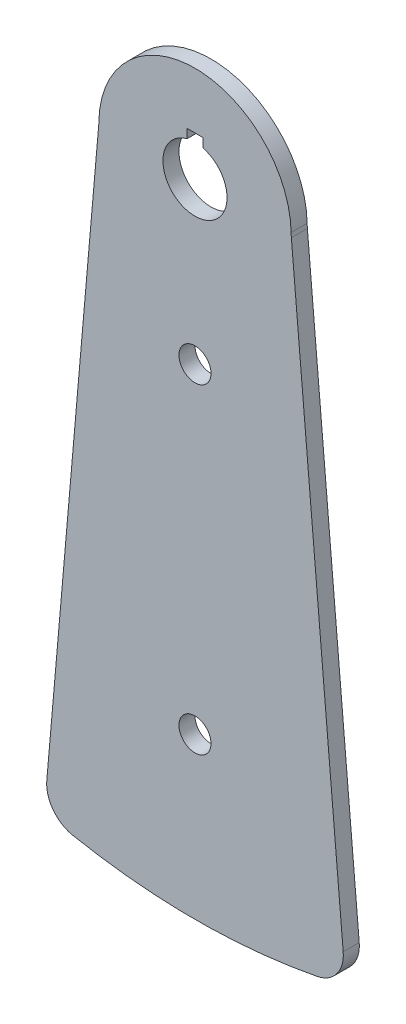
ISO-10303-21;
HEADER;
FILE_DESCRIPTION(('STEP AP214'),'2;1');
FILE_NAME('part.step','',(''),(''),'','','');
FILE_SCHEMA(('AUTOMOTIVE_DESIGN { 1 0 10303 214 1 1 1 1 }'));
ENDSEC;
DATA;
#1=APPLICATION_CONTEXT('core data for automotive mechanical design processes');
#2=APPLICATION_PROTOCOL_DEFINITION('international standard','automotive_design',2000,#1);
#3=PRODUCT_CONTEXT('',#1,'mechanical');
#4=PRODUCT('Part','Part','',(#3));
#5=PRODUCT_RELATED_PRODUCT_CATEGORY('part','',(#4));
#6=PRODUCT_DEFINITION_FORMATION('','',#4);
#7=PRODUCT_DEFINITION_CONTEXT('part definition',#1,'design');
#8=PRODUCT_DEFINITION('design','',#6,#7);
#9=PRODUCT_DEFINITION_SHAPE('','',#8);
#10=(LENGTH_UNIT() NAMED_UNIT(*) SI_UNIT(.MILLI.,.METRE.));
#11=(NAMED_UNIT(*) PLANE_ANGLE_UNIT() SI_UNIT($,.RADIAN.));
#12=(NAMED_UNIT(*) SI_UNIT($,.STERADIAN.) SOLID_ANGLE_UNIT());
#13=UNCERTAINTY_MEASURE_WITH_UNIT(LENGTH_MEASURE(1.E-05),#10,'distance_accuracy_value','');
#14=(GEOMETRIC_REPRESENTATION_CONTEXT(3) GLOBAL_UNCERTAINTY_ASSIGNED_CONTEXT((#13)) GLOBAL_UNIT_ASSIGNED_CONTEXT((#10,
#11,#12)) REPRESENTATION_CONTEXT('',''));
#15=CARTESIAN_POINT('',(0.,0.,0.));
#16=DIRECTION('',(0.,0.,1.));
#17=DIRECTION('',(1.,0.,0.));
#18=AXIS2_PLACEMENT_3D('',#15,#16,#17);
#19=CARTESIAN_POINT('',(0.,0.,3.175));
#20=DIRECTION('',(0.,0.,1.));
#21=DIRECTION('',(1.,0.,0.));
#22=AXIS2_PLACEMENT_3D('',#19,#20,#21);
#23=PLANE('',#22);
#24=CARTESIAN_POINT('',(0.,-190.5,3.175));
#25=DIRECTION('',(0.,0.,1.));
#26=DIRECTION('',(1.,0.,0.));
#27=AXIS2_PLACEMENT_3D('',#24,#25,#26);
#28=CIRCLE('',#27,6.35);
#29=CARTESIAN_POINT('',(6.35000000000002,-190.5,3.175));
#30=VERTEX_POINT('',#29);
#31=EDGE_CURVE('E401',#30,#30,#28,.T.);
#32=ORIENTED_EDGE('',*,*,#31,.F.);
#33=EDGE_LOOP('',(#32));
#34=FACE_BOUND('',#33,.T.);
#35=CARTESIAN_POINT('',(0.,-63.5,3.175));
#36=DIRECTION('',(0.,0.,1.));
#37=DIRECTION('',(1.,0.,0.));
#38=AXIS2_PLACEMENT_3D('',#35,#36,#37);
#39=CIRCLE('',#38,6.35);
#40=CARTESIAN_POINT('',(6.35000000000001,-63.5,3.175));
#41=VERTEX_POINT('',#40);
#42=EDGE_CURVE('E154',#41,#41,#39,.T.);
#43=ORIENTED_EDGE('',*,*,#42,.F.);
#44=EDGE_LOOP('',(#43));
#45=FACE_BOUND('',#44,.T.);
#46=CARTESIAN_POINT('',(0.,0.,3.175));
#47=DIRECTION('',(0.,0.,1.));
#48=DIRECTION('',(1.,0.,0.));
#49=AXIS2_PLACEMENT_3D('',#46,#47,#48);
#50=CIRCLE('',#49,254.);
#51=CARTESIAN_POINT('',(-48.4990435923038,-249.326779088472,3.175));
#52=VERTEX_POINT('',#51);
#53=CARTESIAN_POINT('',(48.4990435923038,-249.326779088472,3.175));
#54=VERTEX_POINT('',#53);
#55=EDGE_CURVE('E170',#52,#54,#50,.T.);
#56=ORIENTED_EDGE('',*,*,#55,.T.);
#57=CARTESIAN_POINT('',(46.0740914126886,-236.860440134049,3.175));
#58=DIRECTION('',(0.,0.,1.));
#59=DIRECTION('',(1.,0.,0.));
#60=AXIS2_PLACEMENT_3D('',#57,#58,#59);
#61=CIRCLE('',#60,12.7);
#62=CARTESIAN_POINT('',(58.7257640784538,-235.753562201153,3.175));
#63=VERTEX_POINT('',#62);
#64=EDGE_CURVE('E44',#54,#63,#61,.T.);
#65=ORIENTED_EDGE('',*,*,#64,.T.);
#66=DIRECTION('',(-0.0871557427476544,0.996194698091746,0.));
#67=VECTOR('',#66,1.);
#68=CARTESIAN_POINT('',(38.1843597954435,-0.964236874169337,3.175));
#69=LINE('',#68,#67);
#70=CARTESIAN_POINT('',(38.1843597954435,-0.964236874169344,3.175));
#71=VERTEX_POINT('',#70);
#72=EDGE_CURVE('E172',#63,#71,#69,.T.);
#73=ORIENTED_EDGE('',*,*,#72,.T.);
#74=CARTESIAN_POINT('',(63.4877051269738,1.24951899162109,3.175));
#75=DIRECTION('',(0.,0.,-1.));
#76=DIRECTION('',(-1.,0.,0.));
#77=AXIS2_PLACEMENT_3D('',#74,#75,#76);
#78=CIRCLE('',#77,25.4);
#79=CARTESIAN_POINT('',(38.0926230761843,0.749711394972652,3.175));
#80=VERTEX_POINT('',#79);
#81=EDGE_CURVE('E175',#71,#80,#78,.T.);
#82=ORIENTED_EDGE('',*,*,#81,.T.);
#83=CARTESIAN_POINT('',(0.,0.,3.175));
#84=DIRECTION('',(0.,0.,1.));
#85=DIRECTION('',(1.,0.,0.));
#86=AXIS2_PLACEMENT_3D('',#83,#84,#85);
#87=CIRCLE('',#86,38.1);
#88=CARTESIAN_POINT('',(-38.0926230761843,0.74971139497264,3.175));
#89=VERTEX_POINT('',#88);
#90=EDGE_CURVE('E177',#80,#89,#87,.T.);
#91=ORIENTED_EDGE('',*,*,#90,.T.);
#92=CARTESIAN_POINT('',(-63.4877051269738,1.24951899162107,3.175));
#93=DIRECTION('',(0.,0.,-1.));
#94=DIRECTION('',(1.,0.,0.));
#95=AXIS2_PLACEMENT_3D('',#92,#93,#94);
#96=CIRCLE('',#95,25.4);
#97=CARTESIAN_POINT('',(-38.1843597954435,-0.964236874169347,3.175));
#98=VERTEX_POINT('',#97);
#99=EDGE_CURVE('E179',#89,#98,#96,.T.);
#100=ORIENTED_EDGE('',*,*,#99,.T.);
#101=DIRECTION('',(-0.0871557427476543,-0.996194698091746,0.));
#102=VECTOR('',#101,1.);
#103=CARTESIAN_POINT('',(-59.6995953012024,-246.884504011233,3.175));
#104=LINE('',#103,#102);
#105=CARTESIAN_POINT('',(-58.7257640784538,-235.753562201153,3.175));
#106=VERTEX_POINT('',#105);
#107=EDGE_CURVE('E181',#98,#106,#104,.T.);
#108=ORIENTED_EDGE('',*,*,#107,.T.);
#109=CARTESIAN_POINT('',(-46.0740914126886,-236.860440134049,3.175));
#110=DIRECTION('',(0.,0.,1.));
#111=DIRECTION('',(1.,0.,0.));
#112=AXIS2_PLACEMENT_3D('',#109,#110,#111);
#113=CIRCLE('',#112,12.7);
#114=EDGE_CURVE('E220',#106,#52,#113,.T.);
#115=ORIENTED_EDGE('',*,*,#114,.T.);
#116=EDGE_LOOP('',(#56,#65,#73,#82,#91,#100,#108,#115));
#117=FACE_BOUND('',#116,.T.);
#118=CARTESIAN_POINT('',(0.,0.,3.175));
#119=DIRECTION('',(0.,0.,1.));
#120=DIRECTION('',(1.,0.,0.));
#121=AXIS2_PLACEMENT_3D('',#118,#119,#120);
#122=CIRCLE('',#121,12.7);
#123=CARTESIAN_POINT('',(-3.175,12.2967221242086,3.175));
#124=VERTEX_POINT('',#123);
#125=CARTESIAN_POINT('',(3.175,12.2967221242085,3.175));
#126=VERTEX_POINT('',#125);
#127=EDGE_CURVE('E150',#124,#126,#122,.T.);
#128=ORIENTED_EDGE('',*,*,#127,.F.);
#129=DIRECTION('',(0.,1.,0.));
#130=VECTOR('',#129,1.);
#131=CARTESIAN_POINT('',(-3.175,9.525,3.175));
#132=LINE('',#131,#130);
#133=CARTESIAN_POINT('',(-3.175,15.875,3.175));
#134=VERTEX_POINT('',#133);
#135=EDGE_CURVE('E130',#124,#134,#132,.T.);
#136=ORIENTED_EDGE('',*,*,#135,.T.);
#137=DIRECTION('',(-1.,0.,0.));
#138=VECTOR('',#137,1.);
#139=CARTESIAN_POINT('',(3.175,15.875,3.175));
#140=LINE('',#139,#138);
#141=CARTESIAN_POINT('',(3.175,15.875,3.175));
#142=VERTEX_POINT('',#141);
#143=EDGE_CURVE('E142',#142,#134,#140,.T.);
#144=ORIENTED_EDGE('',*,*,#143,.F.);
#145=DIRECTION('',(0.,1.,0.));
#146=VECTOR('',#145,1.);
#147=CARTESIAN_POINT('',(3.175,9.525,3.175));
#148=LINE('',#147,#146);
#149=EDGE_CURVE('E146',#126,#142,#148,.T.);
#150=ORIENTED_EDGE('',*,*,#149,.F.);
#151=EDGE_LOOP('',(#128,#136,#144,#150));
#152=FACE_BOUND('',#151,.T.);
#153=ADVANCED_FACE('F36',(#34,#45,#117,#152),#23,.T.);
#154=CARTESIAN_POINT('',(0.,0.,-3.175));
#155=DIRECTION('',(0.,0.,1.));
#156=DIRECTION('',(1.,0.,0.));
#157=AXIS2_PLACEMENT_3D('',#154,#155,#156);
#158=PLANE('',#157);
#159=CARTESIAN_POINT('',(0.,-190.5,-3.175));
#160=DIRECTION('',(0.,0.,1.));
#161=DIRECTION('',(1.,0.,0.));
#162=AXIS2_PLACEMENT_3D('',#159,#160,#161);
#163=CIRCLE('',#162,6.35);
#164=CARTESIAN_POINT('',(6.35000000000002,-190.5,-3.175));
#165=VERTEX_POINT('',#164);
#166=EDGE_CURVE('E399',#165,#165,#163,.T.);
#167=ORIENTED_EDGE('',*,*,#166,.T.);
#168=EDGE_LOOP('',(#167));
#169=FACE_BOUND('',#168,.T.);
#170=CARTESIAN_POINT('',(0.,-63.5,-3.175));
#171=DIRECTION('',(0.,0.,1.));
#172=DIRECTION('',(1.,0.,0.));
#173=AXIS2_PLACEMENT_3D('',#170,#171,#172);
#174=CIRCLE('',#173,6.35);
#175=CARTESIAN_POINT('',(6.35000000000001,-63.5,-3.175));
#176=VERTEX_POINT('',#175);
#177=EDGE_CURVE('E151',#176,#176,#174,.T.);
#178=ORIENTED_EDGE('',*,*,#177,.T.);
#179=EDGE_LOOP('',(#178));
#180=FACE_BOUND('',#179,.T.);
#181=DIRECTION('',(-0.0871557427476544,0.996194698091746,0.));
#182=VECTOR('',#181,1.);
#183=CARTESIAN_POINT('',(38.1843597954435,-0.964236874169337,-3.175));
#184=LINE('',#183,#182);
#185=CARTESIAN_POINT('',(58.7257640784538,-235.753562201153,-3.175));
#186=VERTEX_POINT('',#185);
#187=CARTESIAN_POINT('',(38.1843597954435,-0.964236874169344,-3.175));
#188=VERTEX_POINT('',#187);
#189=EDGE_CURVE('E185',#186,#188,#184,.T.);
#190=ORIENTED_EDGE('',*,*,#189,.F.);
#191=CARTESIAN_POINT('',(46.0740914126886,-236.860440134049,-3.175));
#192=DIRECTION('',(0.,0.,1.));
#193=DIRECTION('',(1.,0.,0.));
#194=AXIS2_PLACEMENT_3D('',#191,#192,#193);
#195=CIRCLE('',#194,12.7);
#196=CARTESIAN_POINT('',(48.4990435923038,-249.326779088472,-3.175));
#197=VERTEX_POINT('',#196);
#198=EDGE_CURVE('E214',#186,#197,#195,.F.);
#199=ORIENTED_EDGE('',*,*,#198,.T.);
#200=CARTESIAN_POINT('',(0.,0.,-3.175));
#201=DIRECTION('',(0.,0.,1.));
#202=DIRECTION('',(1.,0.,0.));
#203=AXIS2_PLACEMENT_3D('',#200,#201,#202);
#204=CIRCLE('',#203,254.);
#205=CARTESIAN_POINT('',(-48.4990435923038,-249.326779088472,-3.175));
#206=VERTEX_POINT('',#205);
#207=EDGE_CURVE('E167',#206,#197,#204,.T.);
#208=ORIENTED_EDGE('',*,*,#207,.F.);
#209=CARTESIAN_POINT('',(-46.0740914126886,-236.860440134049,-3.175));
#210=DIRECTION('',(0.,0.,1.));
#211=DIRECTION('',(1.,0.,0.));
#212=AXIS2_PLACEMENT_3D('',#209,#210,#211);
#213=CIRCLE('',#212,12.7);
#214=CARTESIAN_POINT('',(-58.7257640784538,-235.753562201153,-3.175));
#215=VERTEX_POINT('',#214);
#216=EDGE_CURVE('E212',#206,#215,#213,.F.);
#217=ORIENTED_EDGE('',*,*,#216,.T.);
#218=DIRECTION('',(-0.0871557427476543,-0.996194698091746,0.));
#219=VECTOR('',#218,1.);
#220=CARTESIAN_POINT('',(-59.6995953012024,-246.884504011233,-3.175));
#221=LINE('',#220,#219);
#222=CARTESIAN_POINT('',(-38.1843597954435,-0.964236874169347,-3.175));
#223=VERTEX_POINT('',#222);
#224=EDGE_CURVE('E173',#223,#215,#221,.T.);
#225=ORIENTED_EDGE('',*,*,#224,.F.);
#226=CARTESIAN_POINT('',(-63.4877051269738,1.24951899162107,-3.175));
#227=DIRECTION('',(0.,0.,-1.));
#228=DIRECTION('',(1.,0.,0.));
#229=AXIS2_PLACEMENT_3D('',#226,#227,#228);
#230=CIRCLE('',#229,25.4);
#231=CARTESIAN_POINT('',(-38.0926230761843,0.74971139497264,-3.175));
#232=VERTEX_POINT('',#231);
#233=EDGE_CURVE('E191',#232,#223,#230,.T.);
#234=ORIENTED_EDGE('',*,*,#233,.F.);
#235=CARTESIAN_POINT('',(0.,0.,-3.175));
#236=DIRECTION('',(0.,0.,1.));
#237=DIRECTION('',(1.,0.,0.));
#238=AXIS2_PLACEMENT_3D('',#235,#236,#237);
#239=CIRCLE('',#238,38.1);
#240=CARTESIAN_POINT('',(38.0926230761843,0.749711394972652,-3.175));
#241=VERTEX_POINT('',#240);
#242=EDGE_CURVE('E189',#241,#232,#239,.T.);
#243=ORIENTED_EDGE('',*,*,#242,.F.);
#244=CARTESIAN_POINT('',(63.4877051269738,1.24951899162109,-3.175));
#245=DIRECTION('',(0.,0.,-1.));
#246=DIRECTION('',(-1.,0.,0.));
#247=AXIS2_PLACEMENT_3D('',#244,#245,#246);
#248=CIRCLE('',#247,25.4);
#249=EDGE_CURVE('E187',#188,#241,#248,.T.);
#250=ORIENTED_EDGE('',*,*,#249,.F.);
#251=EDGE_LOOP('',(#190,#199,#208,#217,#225,#234,#243,#250));
#252=FACE_BOUND('',#251,.T.);
#253=DIRECTION('',(0.,1.,0.));
#254=VECTOR('',#253,1.);
#255=CARTESIAN_POINT('',(-3.175,9.525,-3.175));
#256=LINE('',#255,#254);
#257=CARTESIAN_POINT('',(-3.175,12.2967221242086,-3.175));
#258=VERTEX_POINT('',#257);
#259=CARTESIAN_POINT('',(-3.175,15.875,-3.175));
#260=VERTEX_POINT('',#259);
#261=EDGE_CURVE('E133',#258,#260,#256,.T.);
#262=ORIENTED_EDGE('',*,*,#261,.F.);
#263=CARTESIAN_POINT('',(0.,0.,-3.175));
#264=DIRECTION('',(0.,0.,1.));
#265=DIRECTION('',(1.,0.,0.));
#266=AXIS2_PLACEMENT_3D('',#263,#264,#265);
#267=CIRCLE('',#266,12.7);
#268=CARTESIAN_POINT('',(3.175,12.2967221242085,-3.175));
#269=VERTEX_POINT('',#268);
#270=EDGE_CURVE('E137',#258,#269,#267,.T.);
#271=ORIENTED_EDGE('',*,*,#270,.T.);
#272=DIRECTION('',(0.,1.,0.));
#273=VECTOR('',#272,1.);
#274=CARTESIAN_POINT('',(3.175,9.525,-3.175));
#275=LINE('',#274,#273);
#276=CARTESIAN_POINT('',(3.175,15.875,-3.175));
#277=VERTEX_POINT('',#276);
#278=EDGE_CURVE('E162',#269,#277,#275,.T.);
#279=ORIENTED_EDGE('',*,*,#278,.T.);
#280=DIRECTION('',(-1.,0.,0.));
#281=VECTOR('',#280,1.);
#282=CARTESIAN_POINT('',(3.175,15.875,-3.175));
#283=LINE('',#282,#281);
#284=EDGE_CURVE('E160',#277,#260,#283,.T.);
#285=ORIENTED_EDGE('',*,*,#284,.T.);
#286=EDGE_LOOP('',(#262,#271,#279,#285));
#287=FACE_BOUND('',#286,.T.);
#288=ADVANCED_FACE('F234',(#169,#180,#252,#287),#158,.F.);
#289=CARTESIAN_POINT('',(0.,0.,3.175));
#290=DIRECTION('',(0.,0.,-1.));
#291=DIRECTION('',(-1.,0.,0.));
#292=AXIS2_PLACEMENT_3D('',#289,#290,#291);
#293=CYLINDRICAL_SURFACE('',#292,12.7);
#294=ORIENTED_EDGE('',*,*,#270,.F.);
#295=DIRECTION('',(0.,0.,-1.));
#296=VECTOR('',#295,1.);
#297=CARTESIAN_POINT('',(-3.175,12.2967221242086,3.175));
#298=LINE('',#297,#296);
#299=EDGE_CURVE('E207',#258,#124,#298,.F.);
#300=ORIENTED_EDGE('',*,*,#299,.T.);
#301=ORIENTED_EDGE('',*,*,#127,.T.);
#302=DIRECTION('',(0.,0.,-1.));
#303=VECTOR('',#302,1.);
#304=CARTESIAN_POINT('',(3.175,12.2967221242085,3.175));
#305=LINE('',#304,#303);
#306=EDGE_CURVE('E205',#269,#126,#305,.F.);
#307=ORIENTED_EDGE('',*,*,#306,.F.);
#308=EDGE_LOOP('',(#294,#300,#301,#307));
#309=FACE_BOUND('',#308,.T.);
#310=ADVANCED_FACE('F272',(#309),#293,.F.);
#311=CARTESIAN_POINT('',(0.,0.,3.175));
#312=DIRECTION('',(0.,0.,-1.));
#313=DIRECTION('',(-1.,0.,0.));
#314=AXIS2_PLACEMENT_3D('',#311,#312,#313);
#315=CYLINDRICAL_SURFACE('',#314,254.);
#316=ORIENTED_EDGE('',*,*,#207,.T.);
#317=DIRECTION('',(0.,0.,-1.));
#318=VECTOR('',#317,1.);
#319=CARTESIAN_POINT('',(48.4990435923038,-249.326779088472,3.175));
#320=LINE('',#319,#318);
#321=EDGE_CURVE('E57',#197,#54,#320,.F.);
#322=ORIENTED_EDGE('',*,*,#321,.T.);
#323=ORIENTED_EDGE('',*,*,#55,.F.);
#324=DIRECTION('',(0.,0.,-1.));
#325=VECTOR('',#324,1.);
#326=CARTESIAN_POINT('',(-48.4990435923038,-249.326779088472,3.175));
#327=LINE('',#326,#325);
#328=EDGE_CURVE('E216',#52,#206,#327,.T.);
#329=ORIENTED_EDGE('',*,*,#328,.T.);
#330=EDGE_LOOP('',(#316,#322,#323,#329));
#331=FACE_BOUND('',#330,.T.);
#332=ADVANCED_FACE('F237',(#331),#315,.T.);
#333=CARTESIAN_POINT('',(38.1843597954435,-0.964236874169337,3.175));
#334=DIRECTION('',(-0.996194698091746,-0.0871557427476544,0.));
#335=DIRECTION('',(0.0871557427476545,-0.996194698091746,0.));
#336=AXIS2_PLACEMENT_3D('',#333,#334,#335);
#337=PLANE('',#336);
#338=ORIENTED_EDGE('',*,*,#72,.F.);
#339=DIRECTION('',(0.,0.,-1.));
#340=VECTOR('',#339,1.);
#341=CARTESIAN_POINT('',(58.7257640784538,-235.753562201153,3.175));
#342=LINE('',#341,#340);
#343=EDGE_CURVE('E209',#63,#186,#342,.T.);
#344=ORIENTED_EDGE('',*,*,#343,.T.);
#345=ORIENTED_EDGE('',*,*,#189,.T.);
#346=DIRECTION('',(0.,0.,-1.));
#347=VECTOR('',#346,1.);
#348=CARTESIAN_POINT('',(38.1843597954435,-0.964236874169344,3.175));
#349=LINE('',#348,#347);
#350=EDGE_CURVE('E202',#71,#188,#349,.T.);
#351=ORIENTED_EDGE('',*,*,#350,.F.);
#352=EDGE_LOOP('',(#338,#344,#345,#351));
#353=FACE_BOUND('',#352,.T.);
#354=ADVANCED_FACE('F228',(#353),#337,.F.);
#355=CARTESIAN_POINT('',(63.4877051269738,1.24951899162109,3.175));
#356=DIRECTION('',(0.,0.,-1.));
#357=DIRECTION('',(-1.,0.,0.));
#358=AXIS2_PLACEMENT_3D('',#355,#356,#357);
#359=CYLINDRICAL_SURFACE('',#358,25.4);
#360=ORIENTED_EDGE('',*,*,#249,.T.);
#361=DIRECTION('',(0.,0.,-1.));
#362=VECTOR('',#361,1.);
#363=CARTESIAN_POINT('',(38.0926230761843,0.749711394972652,3.175));
#364=LINE('',#363,#362);
#365=EDGE_CURVE('E199',#80,#241,#364,.T.);
#366=ORIENTED_EDGE('',*,*,#365,.F.);
#367=ORIENTED_EDGE('',*,*,#81,.F.);
#368=ORIENTED_EDGE('',*,*,#350,.T.);
#369=EDGE_LOOP('',(#360,#366,#367,#368));
#370=FACE_BOUND('',#369,.T.);
#371=ADVANCED_FACE('F255',(#370),#359,.F.);
#372=CARTESIAN_POINT('',(0.,0.,3.175));
#373=DIRECTION('',(0.,0.,-1.));
#374=DIRECTION('',(-1.,0.,0.));
#375=AXIS2_PLACEMENT_3D('',#372,#373,#374);
#376=CYLINDRICAL_SURFACE('',#375,38.1);
#377=ORIENTED_EDGE('',*,*,#242,.T.);
#378=DIRECTION('',(0.,0.,-1.));
#379=VECTOR('',#378,1.);
#380=CARTESIAN_POINT('',(-38.0926230761843,0.74971139497264,3.175));
#381=LINE('',#380,#379);
#382=EDGE_CURVE('E196',#89,#232,#381,.T.);
#383=ORIENTED_EDGE('',*,*,#382,.F.);
#384=ORIENTED_EDGE('',*,*,#90,.F.);
#385=ORIENTED_EDGE('',*,*,#365,.T.);
#386=EDGE_LOOP('',(#377,#383,#384,#385));
#387=FACE_BOUND('',#386,.T.);
#388=ADVANCED_FACE('F251',(#387),#376,.T.);
#389=CARTESIAN_POINT('',(-63.4877051269738,1.24951899162107,3.175));
#390=DIRECTION('',(0.,0.,-1.));
#391=DIRECTION('',(-1.,0.,0.));
#392=AXIS2_PLACEMENT_3D('',#389,#390,#391);
#393=CYLINDRICAL_SURFACE('',#392,25.4);
#394=ORIENTED_EDGE('',*,*,#233,.T.);
#395=DIRECTION('',(0.,0.,-1.));
#396=VECTOR('',#395,1.);
#397=CARTESIAN_POINT('',(-38.1843597954435,-0.964236874169347,3.175));
#398=LINE('',#397,#396);
#399=EDGE_CURVE('E183',#98,#223,#398,.T.);
#400=ORIENTED_EDGE('',*,*,#399,.F.);
#401=ORIENTED_EDGE('',*,*,#99,.F.);
#402=ORIENTED_EDGE('',*,*,#382,.T.);
#403=EDGE_LOOP('',(#394,#400,#401,#402));
#404=FACE_BOUND('',#403,.T.);
#405=ADVANCED_FACE('F247',(#404),#393,.F.);
#406=CARTESIAN_POINT('',(-59.6995953012024,-246.884504011233,3.175));
#407=DIRECTION('',(0.996194698091746,-0.0871557427476543,0.));
#408=DIRECTION('',(0.0871557427476543,0.996194698091746,0.));
#409=AXIS2_PLACEMENT_3D('',#406,#407,#408);
#410=PLANE('',#409);
#411=ORIENTED_EDGE('',*,*,#224,.T.);
#412=DIRECTION('',(0.,0.,-1.));
#413=VECTOR('',#412,1.);
#414=CARTESIAN_POINT('',(-58.7257640784538,-235.753562201153,3.175));
#415=LINE('',#414,#413);
#416=EDGE_CURVE('E11',#215,#106,#415,.F.);
#417=ORIENTED_EDGE('',*,*,#416,.T.);
#418=ORIENTED_EDGE('',*,*,#107,.F.);
#419=ORIENTED_EDGE('',*,*,#399,.T.);
#420=EDGE_LOOP('',(#411,#417,#418,#419));
#421=FACE_BOUND('',#420,.T.);
#422=ADVANCED_FACE('F243',(#421),#410,.F.);
#423=CARTESIAN_POINT('',(-3.175,9.525,-3.175));
#424=DIRECTION('',(1.,0.,0.));
#425=DIRECTION('',(0.,0.,-1.));
#426=AXIS2_PLACEMENT_3D('',#423,#424,#425);
#427=PLANE('',#426);
#428=ORIENTED_EDGE('',*,*,#261,.T.);
#429=DIRECTION('',(0.,0.,1.));
#430=VECTOR('',#429,1.);
#431=CARTESIAN_POINT('',(-3.175,15.875,-3.175));
#432=LINE('',#431,#430);
#433=EDGE_CURVE('E126',#260,#134,#432,.T.);
#434=ORIENTED_EDGE('',*,*,#433,.T.);
#435=ORIENTED_EDGE('',*,*,#135,.F.);
#436=ORIENTED_EDGE('',*,*,#299,.F.);
#437=EDGE_LOOP('',(#428,#434,#435,#436));
#438=FACE_BOUND('',#437,.T.);
#439=ADVANCED_FACE('F128',(#438),#427,.T.);
#440=CARTESIAN_POINT('',(3.175,15.875,-3.175));
#441=DIRECTION('',(0.,1.,0.));
#442=DIRECTION('',(0.,0.,1.));
#443=AXIS2_PLACEMENT_3D('',#440,#441,#442);
#444=PLANE('',#443);
#445=ORIENTED_EDGE('',*,*,#433,.F.);
#446=ORIENTED_EDGE('',*,*,#284,.F.);
#447=DIRECTION('',(0.,0.,1.));
#448=VECTOR('',#447,1.);
#449=CARTESIAN_POINT('',(3.175,15.875,-3.175));
#450=LINE('',#449,#448);
#451=EDGE_CURVE('E138',#277,#142,#450,.T.);
#452=ORIENTED_EDGE('',*,*,#451,.T.);
#453=ORIENTED_EDGE('',*,*,#143,.T.);
#454=EDGE_LOOP('',(#445,#446,#452,#453));
#455=FACE_BOUND('',#454,.T.);
#456=ADVANCED_FACE('F143',(#455),#444,.F.);
#457=CARTESIAN_POINT('',(3.175,9.525,-3.175));
#458=DIRECTION('',(1.,0.,0.));
#459=DIRECTION('',(0.,0.,-1.));
#460=AXIS2_PLACEMENT_3D('',#457,#458,#459);
#461=PLANE('',#460);
#462=ORIENTED_EDGE('',*,*,#306,.T.);
#463=ORIENTED_EDGE('',*,*,#149,.T.);
#464=ORIENTED_EDGE('',*,*,#451,.F.);
#465=ORIENTED_EDGE('',*,*,#278,.F.);
#466=EDGE_LOOP('',(#462,#463,#464,#465));
#467=FACE_BOUND('',#466,.T.);
#468=ADVANCED_FACE('F307',(#467),#461,.F.);
#469=CARTESIAN_POINT('',(0.,-63.5,-3.175));
#470=DIRECTION('',(0.,0.,1.));
#471=DIRECTION('',(1.,0.,0.));
#472=AXIS2_PLACEMENT_3D('',#469,#470,#471);
#473=CYLINDRICAL_SURFACE('',#472,6.35);
#474=ORIENTED_EDGE('',*,*,#177,.F.);
#475=EDGE_LOOP('',(#474));
#476=FACE_BOUND('',#475,.T.);
#477=ORIENTED_EDGE('',*,*,#42,.T.);
#478=EDGE_LOOP('',(#477));
#479=FACE_BOUND('',#478,.T.);
#480=ADVANCED_FACE('F314',(#476,#479),#473,.F.);
#481=CARTESIAN_POINT('',(0.,-190.5,-3.175));
#482=DIRECTION('',(0.,0.,1.));
#483=DIRECTION('',(1.,0.,0.));
#484=AXIS2_PLACEMENT_3D('',#481,#482,#483);
#485=CYLINDRICAL_SURFACE('',#484,6.35);
#486=ORIENTED_EDGE('',*,*,#166,.F.);
#487=EDGE_LOOP('',(#486));
#488=FACE_BOUND('',#487,.T.);
#489=ORIENTED_EDGE('',*,*,#31,.T.);
#490=EDGE_LOOP('',(#489));
#491=FACE_BOUND('',#490,.T.);
#492=ADVANCED_FACE('F322',(#488,#491),#485,.F.);
#493=CARTESIAN_POINT('',(46.0740914126886,-236.860440134049,3.175));
#494=DIRECTION('',(0.,0.,-1.));
#495=DIRECTION('',(-1.,0.,0.));
#496=AXIS2_PLACEMENT_3D('',#493,#494,#495);
#497=CYLINDRICAL_SURFACE('',#496,12.7);
#498=ORIENTED_EDGE('',*,*,#64,.F.);
#499=ORIENTED_EDGE('',*,*,#321,.F.);
#500=ORIENTED_EDGE('',*,*,#198,.F.);
#501=ORIENTED_EDGE('',*,*,#343,.F.);
#502=EDGE_LOOP('',(#498,#499,#500,#501));
#503=FACE_BOUND('',#502,.T.);
#504=ADVANCED_FACE('F231',(#503),#497,.T.);
#505=CARTESIAN_POINT('',(-46.0740914126886,-236.860440134049,3.175));
#506=DIRECTION('',(0.,0.,-1.));
#507=DIRECTION('',(-1.,0.,0.));
#508=AXIS2_PLACEMENT_3D('',#505,#506,#507);
#509=CYLINDRICAL_SURFACE('',#508,12.7);
#510=ORIENTED_EDGE('',*,*,#114,.F.);
#511=ORIENTED_EDGE('',*,*,#416,.F.);
#512=ORIENTED_EDGE('',*,*,#216,.F.);
#513=ORIENTED_EDGE('',*,*,#328,.F.);
#514=EDGE_LOOP('',(#510,#511,#512,#513));
#515=FACE_BOUND('',#514,.T.);
#516=ADVANCED_FACE('F38',(#515),#509,.T.);
#517=CLOSED_SHELL('',(#153,#288,#310,#332,#354,#371,#388,#405,#422,#439,#456,#468,#480,#492,
#504,#516));
#518=MANIFOLD_SOLID_BREP('B2',#517);
#519=ADVANCED_BREP_SHAPE_REPRESENTATION('',(#18,#518),#14);
#520=SHAPE_DEFINITION_REPRESENTATION(#9,#519);
ENDSEC;
END-ISO-10303-21;
